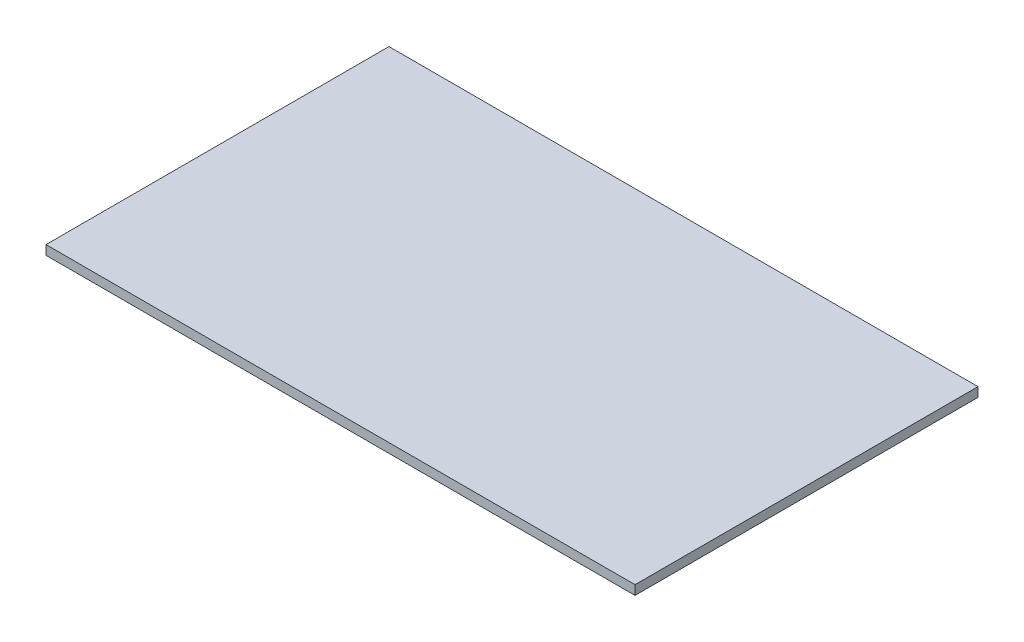
ISO-10303-21;
HEADER;
FILE_DESCRIPTION(('STEP AP214'),'2;1');
FILE_NAME('part.step','',(''),(''),'','','');
FILE_SCHEMA(('AUTOMOTIVE_DESIGN { 1 0 10303 214 1 1 1 1 }'));
ENDSEC;
DATA;
#1=APPLICATION_CONTEXT('core data for automotive mechanical design processes');
#2=APPLICATION_PROTOCOL_DEFINITION('international standard','automotive_design',2000,#1);
#3=PRODUCT_CONTEXT('',#1,'mechanical');
#4=PRODUCT('Part','Part','',(#3));
#5=PRODUCT_RELATED_PRODUCT_CATEGORY('part','',(#4));
#6=PRODUCT_DEFINITION_FORMATION('','',#4);
#7=PRODUCT_DEFINITION_CONTEXT('part definition',#1,'design');
#8=PRODUCT_DEFINITION('design','',#6,#7);
#9=PRODUCT_DEFINITION_SHAPE('','',#8);
#10=(LENGTH_UNIT() NAMED_UNIT(*) SI_UNIT(.MILLI.,.METRE.));
#11=(NAMED_UNIT(*) PLANE_ANGLE_UNIT() SI_UNIT($,.RADIAN.));
#12=(NAMED_UNIT(*) SI_UNIT($,.STERADIAN.) SOLID_ANGLE_UNIT());
#13=UNCERTAINTY_MEASURE_WITH_UNIT(LENGTH_MEASURE(1.E-05),#10,'distance_accuracy_value','');
#14=(GEOMETRIC_REPRESENTATION_CONTEXT(3) GLOBAL_UNCERTAINTY_ASSIGNED_CONTEXT((#13)) GLOBAL_UNIT_ASSIGNED_CONTEXT((#10,
#11,#12)) REPRESENTATION_CONTEXT('',''));
#15=CARTESIAN_POINT('',(0.,0.,0.));
#16=DIRECTION('',(0.,0.,1.));
#17=DIRECTION('',(1.,0.,0.));
#18=AXIS2_PLACEMENT_3D('',#15,#16,#17);
#19=CARTESIAN_POINT('',(-50.165,1.5875,-29.21));
#20=DIRECTION('',(1.,0.,0.));
#21=DIRECTION('',(0.,0.,-1.));
#22=AXIS2_PLACEMENT_3D('',#19,#20,#21);
#23=PLANE('',#22);
#24=DIRECTION('',(0.,0.,1.));
#25=VECTOR('',#24,1.);
#26=CARTESIAN_POINT('',(-50.165,0.,-29.21));
#27=LINE('',#26,#25);
#28=CARTESIAN_POINT('',(-50.165,0.,-29.21));
#29=VERTEX_POINT('',#28);
#30=CARTESIAN_POINT('',(-50.165,0.,29.21));
#31=VERTEX_POINT('',#30);
#32=EDGE_CURVE('E100',#29,#31,#27,.T.);
#33=ORIENTED_EDGE('',*,*,#32,.T.);
#34=DIRECTION('',(0.,-1.,0.));
#35=VECTOR('',#34,1.);
#36=CARTESIAN_POINT('',(-50.165,1.5875,29.21));
#37=LINE('',#36,#35);
#38=CARTESIAN_POINT('',(-50.165,1.5875,29.21));
#39=VERTEX_POINT('',#38);
#40=EDGE_CURVE('E11',#39,#31,#37,.T.);
#41=ORIENTED_EDGE('',*,*,#40,.F.);
#42=DIRECTION('',(0.,0.,1.));
#43=VECTOR('',#42,1.);
#44=CARTESIAN_POINT('',(-50.165,1.5875,-29.21));
#45=LINE('',#44,#43);
#46=CARTESIAN_POINT('',(-50.165,1.5875,-29.21));
#47=VERTEX_POINT('',#46);
#48=EDGE_CURVE('E88',#47,#39,#45,.T.);
#49=ORIENTED_EDGE('',*,*,#48,.F.);
#50=DIRECTION('',(0.,-1.,0.));
#51=VECTOR('',#50,1.);
#52=CARTESIAN_POINT('',(-50.165,1.5875,-29.21));
#53=LINE('',#52,#51);
#54=EDGE_CURVE('E96',#47,#29,#53,.T.);
#55=ORIENTED_EDGE('',*,*,#54,.T.);
#56=EDGE_LOOP('',(#33,#41,#49,#55));
#57=FACE_BOUND('',#56,.T.);
#58=ADVANCED_FACE('F37',(#57),#23,.F.);
#59=CARTESIAN_POINT('',(50.165,1.5875,29.21));
#60=DIRECTION('',(0.,0.,-1.));
#61=DIRECTION('',(-1.,0.,0.));
#62=AXIS2_PLACEMENT_3D('',#59,#60,#61);
#63=PLANE('',#62);
#64=DIRECTION('',(1.,0.,0.));
#65=VECTOR('',#64,1.);
#66=CARTESIAN_POINT('',(50.165,0.,29.21));
#67=LINE('',#66,#65);
#68=CARTESIAN_POINT('',(50.165,0.,29.21));
#69=VERTEX_POINT('',#68);
#70=EDGE_CURVE('E92',#31,#69,#67,.T.);
#71=ORIENTED_EDGE('',*,*,#70,.T.);
#72=DIRECTION('',(0.,-1.,0.));
#73=VECTOR('',#72,1.);
#74=CARTESIAN_POINT('',(50.165,1.5875,29.21));
#75=LINE('',#74,#73);
#76=CARTESIAN_POINT('',(50.165,1.5875,29.21));
#77=VERTEX_POINT('',#76);
#78=EDGE_CURVE('E45',#77,#69,#75,.T.);
#79=ORIENTED_EDGE('',*,*,#78,.F.);
#80=DIRECTION('',(1.,0.,0.));
#81=VECTOR('',#80,1.);
#82=CARTESIAN_POINT('',(50.165,1.5875,29.21));
#83=LINE('',#82,#81);
#84=EDGE_CURVE('E83',#39,#77,#83,.T.);
#85=ORIENTED_EDGE('',*,*,#84,.F.);
#86=ORIENTED_EDGE('',*,*,#40,.T.);
#87=EDGE_LOOP('',(#71,#79,#85,#86));
#88=FACE_BOUND('',#87,.T.);
#89=ADVANCED_FACE('F91',(#88),#63,.F.);
#90=CARTESIAN_POINT('',(50.165,1.5875,-29.21));
#91=DIRECTION('',(-1.,0.,0.));
#92=DIRECTION('',(0.,0.,1.));
#93=AXIS2_PLACEMENT_3D('',#90,#91,#92);
#94=PLANE('',#93);
#95=DIRECTION('',(0.,0.,-1.));
#96=VECTOR('',#95,1.);
#97=CARTESIAN_POINT('',(50.165,0.,-29.21));
#98=LINE('',#97,#96);
#99=CARTESIAN_POINT('',(50.165,0.,-29.21));
#100=VERTEX_POINT('',#99);
#101=EDGE_CURVE('E70',#69,#100,#98,.T.);
#102=ORIENTED_EDGE('',*,*,#101,.T.);
#103=DIRECTION('',(0.,-1.,0.));
#104=VECTOR('',#103,1.);
#105=CARTESIAN_POINT('',(50.165,1.5875,-29.21));
#106=LINE('',#105,#104);
#107=CARTESIAN_POINT('',(50.165,1.5875,-29.21));
#108=VERTEX_POINT('',#107);
#109=EDGE_CURVE('E93',#108,#100,#106,.T.);
#110=ORIENTED_EDGE('',*,*,#109,.F.);
#111=DIRECTION('',(0.,0.,-1.));
#112=VECTOR('',#111,1.);
#113=CARTESIAN_POINT('',(50.165,1.5875,-29.21));
#114=LINE('',#113,#112);
#115=EDGE_CURVE('E86',#77,#108,#114,.T.);
#116=ORIENTED_EDGE('',*,*,#115,.F.);
#117=ORIENTED_EDGE('',*,*,#78,.T.);
#118=EDGE_LOOP('',(#102,#110,#116,#117));
#119=FACE_BOUND('',#118,.T.);
#120=ADVANCED_FACE('F94',(#119),#94,.F.);
#121=CARTESIAN_POINT('',(50.165,1.5875,-29.21));
#122=DIRECTION('',(0.,0.,1.));
#123=DIRECTION('',(1.,0.,0.));
#124=AXIS2_PLACEMENT_3D('',#121,#122,#123);
#125=PLANE('',#124);
#126=DIRECTION('',(-1.,0.,0.));
#127=VECTOR('',#126,1.);
#128=CARTESIAN_POINT('',(50.165,0.,-29.21));
#129=LINE('',#128,#127);
#130=EDGE_CURVE('E76',#100,#29,#129,.T.);
#131=ORIENTED_EDGE('',*,*,#130,.T.);
#132=ORIENTED_EDGE('',*,*,#54,.F.);
#133=DIRECTION('',(-1.,0.,0.));
#134=VECTOR('',#133,1.);
#135=CARTESIAN_POINT('',(50.165,1.5875,-29.21));
#136=LINE('',#135,#134);
#137=EDGE_CURVE('E53',#108,#47,#136,.T.);
#138=ORIENTED_EDGE('',*,*,#137,.F.);
#139=ORIENTED_EDGE('',*,*,#109,.T.);
#140=EDGE_LOOP('',(#131,#132,#138,#139));
#141=FACE_BOUND('',#140,.T.);
#142=ADVANCED_FACE('F107',(#141),#125,.F.);
#143=CARTESIAN_POINT('',(-50.165,1.5875,29.21));
#144=DIRECTION('',(0.,-1.,0.));
#145=DIRECTION('',(0.,0.,-1.));
#146=AXIS2_PLACEMENT_3D('',#143,#144,#145);
#147=PLANE('',#146);
#148=ORIENTED_EDGE('',*,*,#48,.T.);
#149=ORIENTED_EDGE('',*,*,#84,.T.);
#150=ORIENTED_EDGE('',*,*,#115,.T.);
#151=ORIENTED_EDGE('',*,*,#137,.T.);
#152=EDGE_LOOP('',(#148,#149,#150,#151));
#153=FACE_BOUND('',#152,.T.);
#154=ADVANCED_FACE('F84',(#153),#147,.F.);
#155=CARTESIAN_POINT('',(-50.165,0.,29.21));
#156=DIRECTION('',(0.,-1.,0.));
#157=DIRECTION('',(0.,0.,-1.));
#158=AXIS2_PLACEMENT_3D('',#155,#156,#157);
#159=PLANE('',#158);
#160=ORIENTED_EDGE('',*,*,#32,.F.);
#161=ORIENTED_EDGE('',*,*,#130,.F.);
#162=ORIENTED_EDGE('',*,*,#101,.F.);
#163=ORIENTED_EDGE('',*,*,#70,.F.);
#164=EDGE_LOOP('',(#160,#161,#162,#163));
#165=FACE_BOUND('',#164,.T.);
#166=ADVANCED_FACE('F110',(#165),#159,.T.);
#167=CLOSED_SHELL('',(#58,#89,#120,#142,#154,#166));
#168=MANIFOLD_SOLID_BREP('B2',#167);
#169=ADVANCED_BREP_SHAPE_REPRESENTATION('',(#18,#168),#14);
#170=SHAPE_DEFINITION_REPRESENTATION(#9,#169);
ENDSEC;
END-ISO-10303-21;
